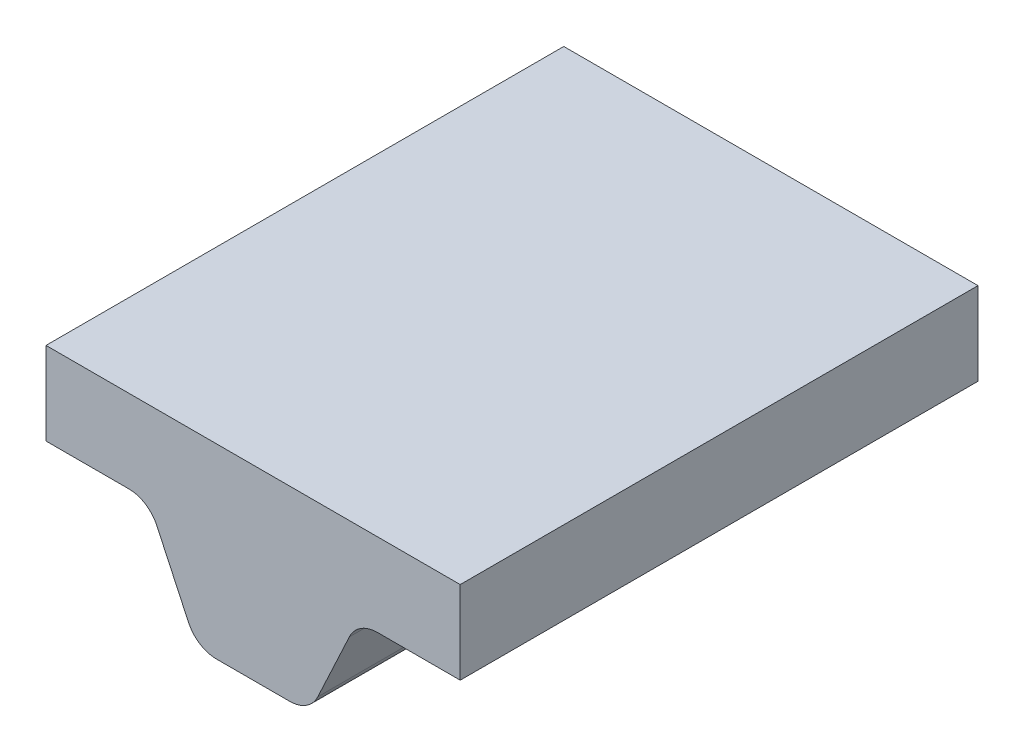
ISO-10303-21;
HEADER;
FILE_DESCRIPTION(('STEP AP214'),'2;1');
FILE_NAME('part.step','',(''),(''),'','','');
FILE_SCHEMA(('AUTOMOTIVE_DESIGN { 1 0 10303 214 1 1 1 1 }'));
ENDSEC;
DATA;
#1=APPLICATION_CONTEXT('core data for automotive mechanical design processes');
#2=APPLICATION_PROTOCOL_DEFINITION('international standard','automotive_design',2000,#1);
#3=PRODUCT_CONTEXT('',#1,'mechanical');
#4=PRODUCT('Part','Part','',(#3));
#5=PRODUCT_RELATED_PRODUCT_CATEGORY('part','',(#4));
#6=PRODUCT_DEFINITION_FORMATION('','',#4);
#7=PRODUCT_DEFINITION_CONTEXT('part definition',#1,'design');
#8=PRODUCT_DEFINITION('design','',#6,#7);
#9=PRODUCT_DEFINITION_SHAPE('','',#8);
#10=(LENGTH_UNIT() NAMED_UNIT(*) SI_UNIT(.MILLI.,.METRE.));
#11=(NAMED_UNIT(*) PLANE_ANGLE_UNIT() SI_UNIT($,.RADIAN.));
#12=(NAMED_UNIT(*) SI_UNIT($,.STERADIAN.) SOLID_ANGLE_UNIT());
#13=UNCERTAINTY_MEASURE_WITH_UNIT(LENGTH_MEASURE(1.E-05),#10,'distance_accuracy_value','');
#14=(GEOMETRIC_REPRESENTATION_CONTEXT(3) GLOBAL_UNCERTAINTY_ASSIGNED_CONTEXT((#13)) GLOBAL_UNIT_ASSIGNED_CONTEXT((#10,
#11,#12)) REPRESENTATION_CONTEXT('',''));
#15=CARTESIAN_POINT('',(0.,0.,0.));
#16=DIRECTION('',(0.,0.,1.));
#17=DIRECTION('',(1.,0.,0.));
#18=AXIS2_PLACEMENT_3D('',#15,#16,#17);
#19=CARTESIAN_POINT('',(-2.54,-0.508,3.175));
#20=DIRECTION('',(1.,0.,0.));
#21=DIRECTION('',(0.,1.,0.));
#22=AXIS2_PLACEMENT_3D('',#19,#20,#21);
#23=PLANE('',#22);
#24=DIRECTION('',(0.,-1.,0.));
#25=VECTOR('',#24,1.);
#26=CARTESIAN_POINT('',(-2.54,-0.508,-3.175));
#27=LINE('',#26,#25);
#28=CARTESIAN_POINT('',(-2.54,0.508,-3.175));
#29=VERTEX_POINT('',#28);
#30=CARTESIAN_POINT('',(-2.54,-0.508,-3.175));
#31=VERTEX_POINT('',#30);
#32=EDGE_CURVE('E170',#29,#31,#27,.T.);
#33=ORIENTED_EDGE('',*,*,#32,.T.);
#34=DIRECTION('',(0.,0.,-1.));
#35=VECTOR('',#34,1.);
#36=CARTESIAN_POINT('',(-2.54,-0.508,3.175));
#37=LINE('',#36,#35);
#38=CARTESIAN_POINT('',(-2.54,-0.508,3.175));
#39=VERTEX_POINT('',#38);
#40=EDGE_CURVE('E11',#39,#31,#37,.T.);
#41=ORIENTED_EDGE('',*,*,#40,.F.);
#42=DIRECTION('',(0.,-1.,0.));
#43=VECTOR('',#42,1.);
#44=CARTESIAN_POINT('',(-2.54,-0.508,3.175));
#45=LINE('',#44,#43);
#46=CARTESIAN_POINT('',(-2.54,0.508,3.175));
#47=VERTEX_POINT('',#46);
#48=EDGE_CURVE('E204',#47,#39,#45,.T.);
#49=ORIENTED_EDGE('',*,*,#48,.F.);
#50=DIRECTION('',(0.,0.,-1.));
#51=VECTOR('',#50,1.);
#52=CARTESIAN_POINT('',(-2.54,0.508,3.175));
#53=LINE('',#52,#51);
#54=EDGE_CURVE('E166',#47,#29,#53,.T.);
#55=ORIENTED_EDGE('',*,*,#54,.T.);
#56=EDGE_LOOP('',(#33,#41,#49,#55));
#57=FACE_BOUND('',#56,.T.);
#58=ADVANCED_FACE('F45',(#57),#23,.F.);
#59=CARTESIAN_POINT('',(-1.52478669910685,-0.508,3.175));
#60=DIRECTION('',(0.,1.,0.));
#61=DIRECTION('',(-1.,0.,0.));
#62=AXIS2_PLACEMENT_3D('',#59,#60,#61);
#63=PLANE('',#62);
#64=DIRECTION('',(1.,0.,0.));
#65=VECTOR('',#64,1.);
#66=CARTESIAN_POINT('',(-1.52478669910685,-0.508,-3.175));
#67=LINE('',#66,#65);
#68=CARTESIAN_POINT('',(-1.52478669910685,-0.508,-3.175));
#69=VERTEX_POINT('',#68);
#70=EDGE_CURVE('E174',#31,#69,#67,.T.);
#71=ORIENTED_EDGE('',*,*,#70,.T.);
#72=DIRECTION('',(0.,0.,-1.));
#73=VECTOR('',#72,1.);
#74=CARTESIAN_POINT('',(-1.52478669910685,-0.508,3.175));
#75=LINE('',#74,#73);
#76=CARTESIAN_POINT('',(-1.52478669910685,-0.508,3.175));
#77=VERTEX_POINT('',#76);
#78=EDGE_CURVE('E54',#77,#69,#75,.T.);
#79=ORIENTED_EDGE('',*,*,#78,.F.);
#80=DIRECTION('',(1.,0.,0.));
#81=VECTOR('',#80,1.);
#82=CARTESIAN_POINT('',(-1.52478669910685,-0.508,3.175));
#83=LINE('',#82,#81);
#84=EDGE_CURVE('E117',#39,#77,#83,.T.);
#85=ORIENTED_EDGE('',*,*,#84,.F.);
#86=ORIENTED_EDGE('',*,*,#40,.T.);
#87=EDGE_LOOP('',(#71,#79,#85,#86));
#88=FACE_BOUND('',#87,.T.);
#89=ADVANCED_FACE('F298',(#88),#63,.F.);
#90=CARTESIAN_POINT('',(-1.52478669910685,-0.888,3.175));
#91=DIRECTION('',(0.,0.,-1.));
#92=DIRECTION('',(-1.,0.,0.));
#93=AXIS2_PLACEMENT_3D('',#90,#91,#92);
#94=CYLINDRICAL_SURFACE('',#93,0.38);
#95=CARTESIAN_POINT('',(-1.52478669910685,-0.888,-3.175));
#96=DIRECTION('',(0.,0.,-1.));
#97=DIRECTION('',(1.,0.,0.));
#98=AXIS2_PLACEMENT_3D('',#95,#96,#97);
#99=CIRCLE('',#98,0.38);
#100=CARTESIAN_POINT('',(-1.18038974003292,-0.727405060538537,-3.175));
#101=VERTEX_POINT('',#100);
#102=EDGE_CURVE('E177',#69,#101,#99,.T.);
#103=ORIENTED_EDGE('',*,*,#102,.T.);
#104=DIRECTION('',(0.,0.,-1.));
#105=VECTOR('',#104,1.);
#106=CARTESIAN_POINT('',(-1.18038974003292,-0.727405060538537,3.175));
#107=LINE('',#106,#105);
#108=CARTESIAN_POINT('',(-1.18038974003292,-0.727405060538537,3.175));
#109=VERTEX_POINT('',#108);
#110=EDGE_CURVE('E231',#109,#101,#107,.T.);
#111=ORIENTED_EDGE('',*,*,#110,.F.);
#112=CARTESIAN_POINT('',(-1.52478669910685,-0.888,3.175));
#113=DIRECTION('',(0.,0.,-1.));
#114=DIRECTION('',(1.,0.,0.));
#115=AXIS2_PLACEMENT_3D('',#112,#113,#114);
#116=CIRCLE('',#115,0.38);
#117=EDGE_CURVE('E241',#77,#109,#116,.T.);
#118=ORIENTED_EDGE('',*,*,#117,.F.);
#119=ORIENTED_EDGE('',*,*,#78,.T.);
#120=EDGE_LOOP('',(#103,#111,#118,#119));
#121=FACE_BOUND('',#120,.T.);
#122=ADVANCED_FACE('F239',(#121),#94,.F.);
#123=CARTESIAN_POINT('',(-1.18038974003292,-0.727405060538537,3.175));
#124=DIRECTION('',(0.906307787036651,0.422618261740697,0.));
#125=DIRECTION('',(-0.422618261740697,0.906307787036651,0.));
#126=AXIS2_PLACEMENT_3D('',#123,#124,#125);
#127=PLANE('',#126);
#128=DIRECTION('',(0.422618261740697,-0.906307787036651,0.));
#129=VECTOR('',#128,1.);
#130=CARTESIAN_POINT('',(-1.18038974003292,-0.727405060538537,-3.175));
#131=LINE('',#130,#129);
#132=CARTESIAN_POINT('',(-0.792799534110236,-1.55859493946146,-3.175));
#133=VERTEX_POINT('',#132);
#134=EDGE_CURVE('E180',#101,#133,#131,.T.);
#135=ORIENTED_EDGE('',*,*,#134,.T.);
#136=DIRECTION('',(0.,0.,-1.));
#137=VECTOR('',#136,1.);
#138=CARTESIAN_POINT('',(-0.792799534110236,-1.55859493946146,3.175));
#139=LINE('',#138,#137);
#140=CARTESIAN_POINT('',(-0.792799534110236,-1.55859493946146,3.175));
#141=VERTEX_POINT('',#140);
#142=EDGE_CURVE('E227',#141,#133,#139,.T.);
#143=ORIENTED_EDGE('',*,*,#142,.F.);
#144=DIRECTION('',(0.422618261740697,-0.906307787036651,0.));
#145=VECTOR('',#144,1.);
#146=CARTESIAN_POINT('',(-1.18038974003292,-0.727405060538537,3.175));
#147=LINE('',#146,#145);
#148=EDGE_CURVE('E260',#109,#141,#147,.T.);
#149=ORIENTED_EDGE('',*,*,#148,.F.);
#150=ORIENTED_EDGE('',*,*,#110,.T.);
#151=EDGE_LOOP('',(#135,#143,#149,#150));
#152=FACE_BOUND('',#151,.T.);
#153=ADVANCED_FACE('F250',(#152),#127,.F.);
#154=CARTESIAN_POINT('',(-0.448402575036308,-1.398,3.175));
#155=DIRECTION('',(0.,0.,-1.));
#156=DIRECTION('',(-1.,0.,0.));
#157=AXIS2_PLACEMENT_3D('',#154,#155,#156);
#158=CYLINDRICAL_SURFACE('',#157,0.38);
#159=CARTESIAN_POINT('',(-0.448402575036308,-1.398,-3.175));
#160=DIRECTION('',(0.,0.,1.));
#161=DIRECTION('',(1.,0.,0.));
#162=AXIS2_PLACEMENT_3D('',#159,#160,#161);
#163=CIRCLE('',#162,0.38);
#164=CARTESIAN_POINT('',(-0.448402575036306,-1.778,-3.175));
#165=VERTEX_POINT('',#164);
#166=EDGE_CURVE('E183',#133,#165,#163,.T.);
#167=ORIENTED_EDGE('',*,*,#166,.T.);
#168=DIRECTION('',(0.,0.,-1.));
#169=VECTOR('',#168,1.);
#170=CARTESIAN_POINT('',(-0.448402575036306,-1.778,3.175));
#171=LINE('',#170,#169);
#172=CARTESIAN_POINT('',(-0.448402575036306,-1.778,3.175));
#173=VERTEX_POINT('',#172);
#174=EDGE_CURVE('E223',#173,#165,#171,.T.);
#175=ORIENTED_EDGE('',*,*,#174,.F.);
#176=CARTESIAN_POINT('',(-0.448402575036308,-1.398,3.175));
#177=DIRECTION('',(0.,0.,1.));
#178=DIRECTION('',(1.,0.,0.));
#179=AXIS2_PLACEMENT_3D('',#176,#177,#178);
#180=CIRCLE('',#179,0.38);
#181=EDGE_CURVE('E256',#141,#173,#180,.T.);
#182=ORIENTED_EDGE('',*,*,#181,.F.);
#183=ORIENTED_EDGE('',*,*,#142,.T.);
#184=EDGE_LOOP('',(#167,#175,#182,#183));
#185=FACE_BOUND('',#184,.T.);
#186=ADVANCED_FACE('F254',(#185),#158,.T.);
#187=CARTESIAN_POINT('',(-0.448402575036306,-1.778,3.175));
#188=DIRECTION('',(0.,1.,0.));
#189=DIRECTION('',(0.,0.,1.));
#190=AXIS2_PLACEMENT_3D('',#187,#188,#189);
#191=PLANE('',#190);
#192=DIRECTION('',(1.,0.,0.));
#193=VECTOR('',#192,1.);
#194=CARTESIAN_POINT('',(-0.448402575036306,-1.778,-3.175));
#195=LINE('',#194,#193);
#196=CARTESIAN_POINT('',(0.448402575036306,-1.778,-3.175));
#197=VERTEX_POINT('',#196);
#198=EDGE_CURVE('E186',#165,#197,#195,.T.);
#199=ORIENTED_EDGE('',*,*,#198,.T.);
#200=DIRECTION('',(0.,0.,-1.));
#201=VECTOR('',#200,1.);
#202=CARTESIAN_POINT('',(0.448402575036306,-1.778,3.175));
#203=LINE('',#202,#201);
#204=CARTESIAN_POINT('',(0.448402575036306,-1.778,3.175));
#205=VERTEX_POINT('',#204);
#206=EDGE_CURVE('E219',#205,#197,#203,.T.);
#207=ORIENTED_EDGE('',*,*,#206,.F.);
#208=DIRECTION('',(1.,0.,0.));
#209=VECTOR('',#208,1.);
#210=CARTESIAN_POINT('',(-0.448402575036306,-1.778,3.175));
#211=LINE('',#210,#209);
#212=EDGE_CURVE('E259',#173,#205,#211,.T.);
#213=ORIENTED_EDGE('',*,*,#212,.F.);
#214=ORIENTED_EDGE('',*,*,#174,.T.);
#215=EDGE_LOOP('',(#199,#207,#213,#214));
#216=FACE_BOUND('',#215,.T.);
#217=ADVANCED_FACE('F311',(#216),#191,.F.);
#218=CARTESIAN_POINT('',(0.448402575036308,-1.398,3.175));
#219=DIRECTION('',(0.,0.,-1.));
#220=DIRECTION('',(-1.,0.,0.));
#221=AXIS2_PLACEMENT_3D('',#218,#219,#220);
#222=CYLINDRICAL_SURFACE('',#221,0.38);
#223=CARTESIAN_POINT('',(0.448402575036308,-1.398,-3.175));
#224=DIRECTION('',(0.,0.,1.));
#225=DIRECTION('',(1.,0.,0.));
#226=AXIS2_PLACEMENT_3D('',#223,#224,#225);
#227=CIRCLE('',#226,0.38);
#228=CARTESIAN_POINT('',(0.792799534110236,-1.55859493946146,-3.175));
#229=VERTEX_POINT('',#228);
#230=EDGE_CURVE('E189',#197,#229,#227,.T.);
#231=ORIENTED_EDGE('',*,*,#230,.T.);
#232=DIRECTION('',(0.,0.,-1.));
#233=VECTOR('',#232,1.);
#234=CARTESIAN_POINT('',(0.792799534110236,-1.55859493946146,3.175));
#235=LINE('',#234,#233);
#236=CARTESIAN_POINT('',(0.792799534110236,-1.55859493946146,3.175));
#237=VERTEX_POINT('',#236);
#238=EDGE_CURVE('E215',#237,#229,#235,.T.);
#239=ORIENTED_EDGE('',*,*,#238,.F.);
#240=CARTESIAN_POINT('',(0.448402575036308,-1.398,3.175));
#241=DIRECTION('',(0.,0.,1.));
#242=DIRECTION('',(1.,0.,0.));
#243=AXIS2_PLACEMENT_3D('',#240,#241,#242);
#244=CIRCLE('',#243,0.38);
#245=EDGE_CURVE('E264',#205,#237,#244,.T.);
#246=ORIENTED_EDGE('',*,*,#245,.F.);
#247=ORIENTED_EDGE('',*,*,#206,.T.);
#248=EDGE_LOOP('',(#231,#239,#246,#247));
#249=FACE_BOUND('',#248,.T.);
#250=ADVANCED_FACE('F314',(#249),#222,.T.);
#251=CARTESIAN_POINT('',(0.792799534110236,-1.55859493946146,3.175));
#252=DIRECTION('',(-0.906307787036651,0.422618261740697,0.));
#253=DIRECTION('',(-0.422618261740697,-0.906307787036651,0.));
#254=AXIS2_PLACEMENT_3D('',#251,#252,#253);
#255=PLANE('',#254);
#256=DIRECTION('',(0.422618261740697,0.906307787036651,0.));
#257=VECTOR('',#256,1.);
#258=CARTESIAN_POINT('',(0.792799534110236,-1.55859493946146,-3.175));
#259=LINE('',#258,#257);
#260=CARTESIAN_POINT('',(1.18038974003292,-0.727405060538537,-3.175));
#261=VERTEX_POINT('',#260);
#262=EDGE_CURVE('E192',#229,#261,#259,.T.);
#263=ORIENTED_EDGE('',*,*,#262,.T.);
#264=DIRECTION('',(0.,0.,-1.));
#265=VECTOR('',#264,1.);
#266=CARTESIAN_POINT('',(1.18038974003292,-0.727405060538537,3.175));
#267=LINE('',#266,#265);
#268=CARTESIAN_POINT('',(1.18038974003292,-0.727405060538537,3.175));
#269=VERTEX_POINT('',#268);
#270=EDGE_CURVE('E211',#269,#261,#267,.T.);
#271=ORIENTED_EDGE('',*,*,#270,.F.);
#272=DIRECTION('',(0.422618261740697,0.906307787036651,0.));
#273=VECTOR('',#272,1.);
#274=CARTESIAN_POINT('',(0.792799534110236,-1.55859493946146,3.175));
#275=LINE('',#274,#273);
#276=EDGE_CURVE('E271',#237,#269,#275,.T.);
#277=ORIENTED_EDGE('',*,*,#276,.F.);
#278=ORIENTED_EDGE('',*,*,#238,.T.);
#279=EDGE_LOOP('',(#263,#271,#277,#278));
#280=FACE_BOUND('',#279,.T.);
#281=ADVANCED_FACE('F279',(#280),#255,.F.);
#282=CARTESIAN_POINT('',(1.52478669910685,-0.888,3.175));
#283=DIRECTION('',(0.,0.,-1.));
#284=DIRECTION('',(-1.,0.,0.));
#285=AXIS2_PLACEMENT_3D('',#282,#283,#284);
#286=CYLINDRICAL_SURFACE('',#285,0.38);
#287=CARTESIAN_POINT('',(1.52478669910685,-0.888,-3.175));
#288=DIRECTION('',(0.,0.,-1.));
#289=DIRECTION('',(-1.,0.,0.));
#290=AXIS2_PLACEMENT_3D('',#287,#288,#289);
#291=CIRCLE('',#290,0.38);
#292=CARTESIAN_POINT('',(1.52478669910685,-0.508,-3.175));
#293=VERTEX_POINT('',#292);
#294=EDGE_CURVE('E195',#261,#293,#291,.T.);
#295=ORIENTED_EDGE('',*,*,#294,.T.);
#296=DIRECTION('',(0.,0.,-1.));
#297=VECTOR('',#296,1.);
#298=CARTESIAN_POINT('',(1.52478669910685,-0.508,3.175));
#299=LINE('',#298,#297);
#300=CARTESIAN_POINT('',(1.52478669910685,-0.508,3.175));
#301=VERTEX_POINT('',#300);
#302=EDGE_CURVE('E159',#301,#293,#299,.T.);
#303=ORIENTED_EDGE('',*,*,#302,.F.);
#304=CARTESIAN_POINT('',(1.52478669910685,-0.888,3.175));
#305=DIRECTION('',(0.,0.,-1.));
#306=DIRECTION('',(-1.,0.,0.));
#307=AXIS2_PLACEMENT_3D('',#304,#305,#306);
#308=CIRCLE('',#307,0.38);
#309=EDGE_CURVE('E148',#269,#301,#308,.T.);
#310=ORIENTED_EDGE('',*,*,#309,.F.);
#311=ORIENTED_EDGE('',*,*,#270,.T.);
#312=EDGE_LOOP('',(#295,#303,#310,#311));
#313=FACE_BOUND('',#312,.T.);
#314=ADVANCED_FACE('F283',(#313),#286,.F.);
#315=CARTESIAN_POINT('',(1.52478669910685,-0.508,3.175));
#316=DIRECTION('',(0.,1.,0.));
#317=DIRECTION('',(-1.,0.,0.));
#318=AXIS2_PLACEMENT_3D('',#315,#316,#317);
#319=PLANE('',#318);
#320=DIRECTION('',(1.,0.,0.));
#321=VECTOR('',#320,1.);
#322=CARTESIAN_POINT('',(1.52478669910685,-0.508,-3.175));
#323=LINE('',#322,#321);
#324=CARTESIAN_POINT('',(2.54,-0.508,-3.175));
#325=VERTEX_POINT('',#324);
#326=EDGE_CURVE('E157',#293,#325,#323,.T.);
#327=ORIENTED_EDGE('',*,*,#326,.T.);
#328=DIRECTION('',(0.,0.,-1.));
#329=VECTOR('',#328,1.);
#330=CARTESIAN_POINT('',(2.54,-0.508,3.175));
#331=LINE('',#330,#329);
#332=CARTESIAN_POINT('',(2.54,-0.508,3.175));
#333=VERTEX_POINT('',#332);
#334=EDGE_CURVE('E154',#333,#325,#331,.T.);
#335=ORIENTED_EDGE('',*,*,#334,.F.);
#336=DIRECTION('',(1.,0.,0.));
#337=VECTOR('',#336,1.);
#338=CARTESIAN_POINT('',(1.52478669910685,-0.508,3.175));
#339=LINE('',#338,#337);
#340=EDGE_CURVE('E142',#301,#333,#339,.T.);
#341=ORIENTED_EDGE('',*,*,#340,.F.);
#342=ORIENTED_EDGE('',*,*,#302,.T.);
#343=EDGE_LOOP('',(#327,#335,#341,#342));
#344=FACE_BOUND('',#343,.T.);
#345=ADVANCED_FACE('F155',(#344),#319,.F.);
#346=CARTESIAN_POINT('',(2.54,-0.508,3.175));
#347=DIRECTION('',(-1.,0.,0.));
#348=DIRECTION('',(0.,0.,1.));
#349=AXIS2_PLACEMENT_3D('',#346,#347,#348);
#350=PLANE('',#349);
#351=DIRECTION('',(0.,1.,0.));
#352=VECTOR('',#351,1.);
#353=CARTESIAN_POINT('',(2.54,-0.508,-3.175));
#354=LINE('',#353,#352);
#355=CARTESIAN_POINT('',(2.54,0.508,-3.175));
#356=VERTEX_POINT('',#355);
#357=EDGE_CURVE('E103',#325,#356,#354,.T.);
#358=ORIENTED_EDGE('',*,*,#357,.T.);
#359=DIRECTION('',(0.,0.,-1.));
#360=VECTOR('',#359,1.);
#361=CARTESIAN_POINT('',(2.54,0.508,3.175));
#362=LINE('',#361,#360);
#363=CARTESIAN_POINT('',(2.54,0.508,3.175));
#364=VERTEX_POINT('',#363);
#365=EDGE_CURVE('E160',#364,#356,#362,.T.);
#366=ORIENTED_EDGE('',*,*,#365,.F.);
#367=DIRECTION('',(0.,1.,0.));
#368=VECTOR('',#367,1.);
#369=CARTESIAN_POINT('',(2.54,-0.508,3.175));
#370=LINE('',#369,#368);
#371=EDGE_CURVE('E146',#333,#364,#370,.T.);
#372=ORIENTED_EDGE('',*,*,#371,.F.);
#373=ORIENTED_EDGE('',*,*,#334,.T.);
#374=EDGE_LOOP('',(#358,#366,#372,#373));
#375=FACE_BOUND('',#374,.T.);
#376=ADVANCED_FACE('F162',(#375),#350,.F.);
#377=CARTESIAN_POINT('',(2.54,0.508,3.175));
#378=DIRECTION('',(0.,-1.,0.));
#379=DIRECTION('',(0.,0.,-1.));
#380=AXIS2_PLACEMENT_3D('',#377,#378,#379);
#381=PLANE('',#380);
#382=DIRECTION('',(-1.,0.,0.));
#383=VECTOR('',#382,1.);
#384=CARTESIAN_POINT('',(2.54,0.508,-3.175));
#385=LINE('',#384,#383);
#386=EDGE_CURVE('E109',#356,#29,#385,.T.);
#387=ORIENTED_EDGE('',*,*,#386,.T.);
#388=ORIENTED_EDGE('',*,*,#54,.F.);
#389=DIRECTION('',(-1.,0.,0.));
#390=VECTOR('',#389,1.);
#391=CARTESIAN_POINT('',(2.54,0.508,3.175));
#392=LINE('',#391,#390);
#393=EDGE_CURVE('E62',#364,#47,#392,.T.);
#394=ORIENTED_EDGE('',*,*,#393,.F.);
#395=ORIENTED_EDGE('',*,*,#365,.T.);
#396=EDGE_LOOP('',(#387,#388,#394,#395));
#397=FACE_BOUND('',#396,.T.);
#398=ADVANCED_FACE('F287',(#397),#381,.F.);
#399=CARTESIAN_POINT('',(1.52478669910685,-0.888,3.175));
#400=DIRECTION('',(0.,0.,-1.));
#401=DIRECTION('',(-1.,0.,0.));
#402=AXIS2_PLACEMENT_3D('',#399,#400,#401);
#403=PLANE('',#402);
#404=ORIENTED_EDGE('',*,*,#48,.T.);
#405=ORIENTED_EDGE('',*,*,#84,.T.);
#406=ORIENTED_EDGE('',*,*,#117,.T.);
#407=ORIENTED_EDGE('',*,*,#148,.T.);
#408=ORIENTED_EDGE('',*,*,#181,.T.);
#409=ORIENTED_EDGE('',*,*,#212,.T.);
#410=ORIENTED_EDGE('',*,*,#245,.T.);
#411=ORIENTED_EDGE('',*,*,#276,.T.);
#412=ORIENTED_EDGE('',*,*,#309,.T.);
#413=ORIENTED_EDGE('',*,*,#340,.T.);
#414=ORIENTED_EDGE('',*,*,#371,.T.);
#415=ORIENTED_EDGE('',*,*,#393,.T.);
#416=EDGE_LOOP('',(#404,#405,#406,#407,#408,#409,#410,#411,#412,#413,#414,#415));
#417=FACE_BOUND('',#416,.T.);
#418=ADVANCED_FACE('F144',(#417),#403,.F.);
#419=CARTESIAN_POINT('',(1.52478669910685,-0.888,-3.175));
#420=DIRECTION('',(0.,0.,-1.));
#421=DIRECTION('',(-1.,0.,0.));
#422=AXIS2_PLACEMENT_3D('',#419,#420,#421);
#423=PLANE('',#422);
#424=ORIENTED_EDGE('',*,*,#32,.F.);
#425=ORIENTED_EDGE('',*,*,#386,.F.);
#426=ORIENTED_EDGE('',*,*,#357,.F.);
#427=ORIENTED_EDGE('',*,*,#326,.F.);
#428=ORIENTED_EDGE('',*,*,#294,.F.);
#429=ORIENTED_EDGE('',*,*,#262,.F.);
#430=ORIENTED_EDGE('',*,*,#230,.F.);
#431=ORIENTED_EDGE('',*,*,#198,.F.);
#432=ORIENTED_EDGE('',*,*,#166,.F.);
#433=ORIENTED_EDGE('',*,*,#134,.F.);
#434=ORIENTED_EDGE('',*,*,#102,.F.);
#435=ORIENTED_EDGE('',*,*,#70,.F.);
#436=EDGE_LOOP('',(#424,#425,#426,#427,#428,#429,#430,#431,#432,#433,#434,#435));
#437=FACE_BOUND('',#436,.T.);
#438=ADVANCED_FACE('F245',(#437),#423,.T.);
#439=CLOSED_SHELL('',(#58,#89,#122,#153,#186,#217,#250,#281,#314,#345,#376,#398,#418,#438));
#440=MANIFOLD_SOLID_BREP('B2',#439);
#441=ADVANCED_BREP_SHAPE_REPRESENTATION('',(#18,#440),#14);
#442=SHAPE_DEFINITION_REPRESENTATION(#9,#441);
ENDSEC;
END-ISO-10303-21;
